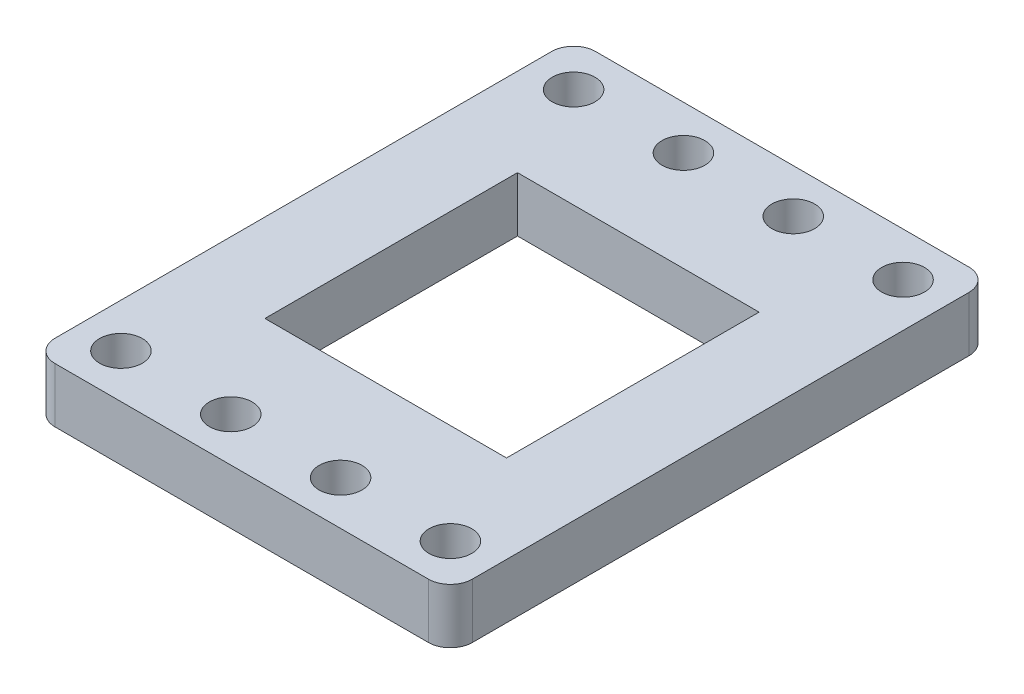
ISO-10303-21;
HEADER;
FILE_DESCRIPTION(('STEP AP214'),'2;1');
FILE_NAME('part.step','',(''),(''),'','','');
FILE_SCHEMA(('AUTOMOTIVE_DESIGN { 1 0 10303 214 1 1 1 1 }'));
ENDSEC;
DATA;
#1=APPLICATION_CONTEXT('core data for automotive mechanical design processes');
#2=APPLICATION_PROTOCOL_DEFINITION('international standard','automotive_design',2000,#1);
#3=PRODUCT_CONTEXT('',#1,'mechanical');
#4=PRODUCT('Part','Part','',(#3));
#5=PRODUCT_RELATED_PRODUCT_CATEGORY('part','',(#4));
#6=PRODUCT_DEFINITION_FORMATION('','',#4);
#7=PRODUCT_DEFINITION_CONTEXT('part definition',#1,'design');
#8=PRODUCT_DEFINITION('design','',#6,#7);
#9=PRODUCT_DEFINITION_SHAPE('','',#8);
#10=(LENGTH_UNIT() NAMED_UNIT(*) SI_UNIT(.MILLI.,.METRE.));
#11=(NAMED_UNIT(*) PLANE_ANGLE_UNIT() SI_UNIT($,.RADIAN.));
#12=(NAMED_UNIT(*) SI_UNIT($,.STERADIAN.) SOLID_ANGLE_UNIT());
#13=UNCERTAINTY_MEASURE_WITH_UNIT(LENGTH_MEASURE(1.E-05),#10,'distance_accuracy_value','');
#14=(GEOMETRIC_REPRESENTATION_CONTEXT(3) GLOBAL_UNCERTAINTY_ASSIGNED_CONTEXT((#13)) GLOBAL_UNIT_ASSIGNED_CONTEXT((#10,
#11,#12)) REPRESENTATION_CONTEXT('',''));
#15=CARTESIAN_POINT('',(0.,0.,0.));
#16=DIRECTION('',(0.,0.,1.));
#17=DIRECTION('',(1.,0.,0.));
#18=AXIS2_PLACEMENT_3D('',#15,#16,#17);
#19=CARTESIAN_POINT('',(-1.99999999999999,5.,47.22));
#20=DIRECTION('',(0.,-1.,0.));
#21=DIRECTION('',(0.,0.,-1.));
#22=AXIS2_PLACEMENT_3D('',#19,#20,#21);
#23=CYLINDRICAL_SURFACE('',#22,2.);
#24=CARTESIAN_POINT('',(-1.99999999999999,0.,47.22));
#25=DIRECTION('',(0.,1.,0.));
#26=DIRECTION('',(0.,0.,1.));
#27=AXIS2_PLACEMENT_3D('',#24,#25,#26);
#28=CIRCLE('',#27,2.);
#29=CARTESIAN_POINT('',(-1.99999999999999,0.,49.22));
#30=VERTEX_POINT('',#29);
#31=CARTESIAN_POINT('',(0.,0.,47.22));
#32=VERTEX_POINT('',#31);
#33=EDGE_CURVE('E201',#30,#32,#28,.T.);
#34=ORIENTED_EDGE('',*,*,#33,.T.);
#35=DIRECTION('',(0.,-1.,0.));
#36=VECTOR('',#35,1.);
#37=CARTESIAN_POINT('',(0.,5.,47.22));
#38=LINE('',#37,#36);
#39=CARTESIAN_POINT('',(0.,5.,47.22));
#40=VERTEX_POINT('',#39);
#41=EDGE_CURVE('E11',#40,#32,#38,.T.);
#42=ORIENTED_EDGE('',*,*,#41,.F.);
#43=CARTESIAN_POINT('',(-1.99999999999999,5.,47.22));
#44=DIRECTION('',(0.,1.,0.));
#45=DIRECTION('',(0.,0.,1.));
#46=AXIS2_PLACEMENT_3D('',#43,#44,#45);
#47=CIRCLE('',#46,2.);
#48=CARTESIAN_POINT('',(-1.99999999999999,5.,49.22));
#49=VERTEX_POINT('',#48);
#50=EDGE_CURVE('E204',#49,#40,#47,.T.);
#51=ORIENTED_EDGE('',*,*,#50,.F.);
#52=DIRECTION('',(0.,-1.,0.));
#53=VECTOR('',#52,1.);
#54=CARTESIAN_POINT('',(-1.99999999999999,5.,49.22));
#55=LINE('',#54,#53);
#56=EDGE_CURVE('E222',#49,#30,#55,.T.);
#57=ORIENTED_EDGE('',*,*,#56,.T.);
#58=EDGE_LOOP('',(#34,#42,#51,#57));
#59=FACE_BOUND('',#58,.T.);
#60=ADVANCED_FACE('F33',(#59),#23,.T.);
#61=CARTESIAN_POINT('',(0.,5.,2.));
#62=DIRECTION('',(-1.,0.,0.));
#63=DIRECTION('',(0.,0.,1.));
#64=AXIS2_PLACEMENT_3D('',#61,#62,#63);
#65=PLANE('',#64);
#66=DIRECTION('',(0.,0.,-1.));
#67=VECTOR('',#66,1.);
#68=CARTESIAN_POINT('',(0.,0.,2.));
#69=LINE('',#68,#67);
#70=CARTESIAN_POINT('',(0.,0.,2.));
#71=VERTEX_POINT('',#70);
#72=EDGE_CURVE('E225',#32,#71,#69,.T.);
#73=ORIENTED_EDGE('',*,*,#72,.T.);
#74=DIRECTION('',(0.,-1.,0.));
#75=VECTOR('',#74,1.);
#76=CARTESIAN_POINT('',(0.,5.,2.));
#77=LINE('',#76,#75);
#78=CARTESIAN_POINT('',(0.,5.,2.));
#79=VERTEX_POINT('',#78);
#80=EDGE_CURVE('E40',#79,#71,#77,.T.);
#81=ORIENTED_EDGE('',*,*,#80,.F.);
#82=DIRECTION('',(0.,0.,-1.));
#83=VECTOR('',#82,1.);
#84=CARTESIAN_POINT('',(0.,5.,2.));
#85=LINE('',#84,#83);
#86=EDGE_CURVE('E207',#40,#79,#85,.T.);
#87=ORIENTED_EDGE('',*,*,#86,.F.);
#88=ORIENTED_EDGE('',*,*,#41,.T.);
#89=EDGE_LOOP('',(#73,#81,#87,#88));
#90=FACE_BOUND('',#89,.T.);
#91=ADVANCED_FACE('F281',(#90),#65,.F.);
#92=CARTESIAN_POINT('',(-2.,5.,2.));
#93=DIRECTION('',(0.,-1.,0.));
#94=DIRECTION('',(0.,0.,-1.));
#95=AXIS2_PLACEMENT_3D('',#92,#93,#94);
#96=CYLINDRICAL_SURFACE('',#95,2.);
#97=CARTESIAN_POINT('',(-2.,0.,2.));
#98=DIRECTION('',(0.,1.,0.));
#99=DIRECTION('',(0.,0.,-1.));
#100=AXIS2_PLACEMENT_3D('',#97,#98,#99);
#101=CIRCLE('',#100,2.);
#102=CARTESIAN_POINT('',(-2.,0.,0.));
#103=VERTEX_POINT('',#102);
#104=EDGE_CURVE('E227',#71,#103,#101,.T.);
#105=ORIENTED_EDGE('',*,*,#104,.T.);
#106=DIRECTION('',(0.,-1.,0.));
#107=VECTOR('',#106,1.);
#108=CARTESIAN_POINT('',(-2.,5.,0.));
#109=LINE('',#108,#107);
#110=CARTESIAN_POINT('',(-2.,5.,0.));
#111=VERTEX_POINT('',#110);
#112=EDGE_CURVE('E252',#111,#103,#109,.T.);
#113=ORIENTED_EDGE('',*,*,#112,.F.);
#114=CARTESIAN_POINT('',(-2.,5.,2.));
#115=DIRECTION('',(0.,1.,0.));
#116=DIRECTION('',(0.,0.,-1.));
#117=AXIS2_PLACEMENT_3D('',#114,#115,#116);
#118=CIRCLE('',#117,2.);
#119=EDGE_CURVE('E210',#79,#111,#118,.T.);
#120=ORIENTED_EDGE('',*,*,#119,.F.);
#121=ORIENTED_EDGE('',*,*,#80,.T.);
#122=EDGE_LOOP('',(#105,#113,#120,#121));
#123=FACE_BOUND('',#122,.T.);
#124=ADVANCED_FACE('F259',(#123),#96,.T.);
#125=CARTESIAN_POINT('',(-36.,5.,0.));
#126=DIRECTION('',(0.,0.,1.));
#127=DIRECTION('',(1.,0.,0.));
#128=AXIS2_PLACEMENT_3D('',#125,#126,#127);
#129=PLANE('',#128);
#130=DIRECTION('',(-1.,0.,0.));
#131=VECTOR('',#130,1.);
#132=CARTESIAN_POINT('',(-36.,0.,0.));
#133=LINE('',#132,#131);
#134=CARTESIAN_POINT('',(-36.,0.,0.));
#135=VERTEX_POINT('',#134);
#136=EDGE_CURVE('E229',#103,#135,#133,.T.);
#137=ORIENTED_EDGE('',*,*,#136,.T.);
#138=DIRECTION('',(0.,-1.,0.));
#139=VECTOR('',#138,1.);
#140=CARTESIAN_POINT('',(-36.,5.,0.));
#141=LINE('',#140,#139);
#142=CARTESIAN_POINT('',(-36.,5.,0.));
#143=VERTEX_POINT('',#142);
#144=EDGE_CURVE('E249',#143,#135,#141,.T.);
#145=ORIENTED_EDGE('',*,*,#144,.F.);
#146=DIRECTION('',(-1.,0.,0.));
#147=VECTOR('',#146,1.);
#148=CARTESIAN_POINT('',(-36.,5.,0.));
#149=LINE('',#148,#147);
#150=EDGE_CURVE('E212',#111,#143,#149,.T.);
#151=ORIENTED_EDGE('',*,*,#150,.F.);
#152=ORIENTED_EDGE('',*,*,#112,.T.);
#153=EDGE_LOOP('',(#137,#145,#151,#152));
#154=FACE_BOUND('',#153,.T.);
#155=ADVANCED_FACE('F269',(#154),#129,.F.);
#156=CARTESIAN_POINT('',(-36.,5.,2.));
#157=DIRECTION('',(0.,-1.,0.));
#158=DIRECTION('',(0.,0.,-1.));
#159=AXIS2_PLACEMENT_3D('',#156,#157,#158);
#160=CYLINDRICAL_SURFACE('',#159,2.);
#161=CARTESIAN_POINT('',(-36.,0.,2.));
#162=DIRECTION('',(0.,1.,0.));
#163=DIRECTION('',(0.,0.,1.));
#164=AXIS2_PLACEMENT_3D('',#161,#162,#163);
#165=CIRCLE('',#164,2.);
#166=CARTESIAN_POINT('',(-38.,0.,2.));
#167=VERTEX_POINT('',#166);
#168=EDGE_CURVE('E231',#135,#167,#165,.T.);
#169=ORIENTED_EDGE('',*,*,#168,.T.);
#170=DIRECTION('',(0.,-1.,0.));
#171=VECTOR('',#170,1.);
#172=CARTESIAN_POINT('',(-38.,5.,2.));
#173=LINE('',#172,#171);
#174=CARTESIAN_POINT('',(-38.,5.,2.));
#175=VERTEX_POINT('',#174);
#176=EDGE_CURVE('E246',#175,#167,#173,.T.);
#177=ORIENTED_EDGE('',*,*,#176,.F.);
#178=CARTESIAN_POINT('',(-36.,5.,2.));
#179=DIRECTION('',(0.,1.,0.));
#180=DIRECTION('',(0.,0.,1.));
#181=AXIS2_PLACEMENT_3D('',#178,#179,#180);
#182=CIRCLE('',#181,2.);
#183=EDGE_CURVE('E214',#143,#175,#182,.T.);
#184=ORIENTED_EDGE('',*,*,#183,.F.);
#185=ORIENTED_EDGE('',*,*,#144,.T.);
#186=EDGE_LOOP('',(#169,#177,#184,#185));
#187=FACE_BOUND('',#186,.T.);
#188=ADVANCED_FACE('F273',(#187),#160,.T.);
#189=CARTESIAN_POINT('',(-38.,5.,2.));
#190=DIRECTION('',(1.,0.,0.));
#191=DIRECTION('',(0.,0.,-1.));
#192=AXIS2_PLACEMENT_3D('',#189,#190,#191);
#193=PLANE('',#192);
#194=DIRECTION('',(0.,0.,1.));
#195=VECTOR('',#194,1.);
#196=CARTESIAN_POINT('',(-38.,0.,2.));
#197=LINE('',#196,#195);
#198=CARTESIAN_POINT('',(-38.,0.,47.22));
#199=VERTEX_POINT('',#198);
#200=EDGE_CURVE('E233',#167,#199,#197,.T.);
#201=ORIENTED_EDGE('',*,*,#200,.T.);
#202=DIRECTION('',(0.,-1.,0.));
#203=VECTOR('',#202,1.);
#204=CARTESIAN_POINT('',(-38.,5.,47.22));
#205=LINE('',#204,#203);
#206=CARTESIAN_POINT('',(-38.,5.,47.22));
#207=VERTEX_POINT('',#206);
#208=EDGE_CURVE('E243',#207,#199,#205,.T.);
#209=ORIENTED_EDGE('',*,*,#208,.F.);
#210=DIRECTION('',(0.,0.,1.));
#211=VECTOR('',#210,1.);
#212=CARTESIAN_POINT('',(-38.,5.,2.));
#213=LINE('',#212,#211);
#214=EDGE_CURVE('E216',#175,#207,#213,.T.);
#215=ORIENTED_EDGE('',*,*,#214,.F.);
#216=ORIENTED_EDGE('',*,*,#176,.T.);
#217=EDGE_LOOP('',(#201,#209,#215,#216));
#218=FACE_BOUND('',#217,.T.);
#219=ADVANCED_FACE('F294',(#218),#193,.F.);
#220=CARTESIAN_POINT('',(-36.,5.,47.22));
#221=DIRECTION('',(0.,-1.,0.));
#222=DIRECTION('',(0.,0.,-1.));
#223=AXIS2_PLACEMENT_3D('',#220,#221,#222);
#224=CYLINDRICAL_SURFACE('',#223,2.);
#225=CARTESIAN_POINT('',(-36.,0.,47.22));
#226=DIRECTION('',(0.,1.,0.));
#227=DIRECTION('',(0.,0.,1.));
#228=AXIS2_PLACEMENT_3D('',#225,#226,#227);
#229=CIRCLE('',#228,2.);
#230=CARTESIAN_POINT('',(-36.,0.,49.22));
#231=VERTEX_POINT('',#230);
#232=EDGE_CURVE('E235',#199,#231,#229,.T.);
#233=ORIENTED_EDGE('',*,*,#232,.T.);
#234=DIRECTION('',(0.,-1.,0.));
#235=VECTOR('',#234,1.);
#236=CARTESIAN_POINT('',(-36.,5.,49.22));
#237=LINE('',#236,#235);
#238=CARTESIAN_POINT('',(-36.,5.,49.22));
#239=VERTEX_POINT('',#238);
#240=EDGE_CURVE('E240',#239,#231,#237,.T.);
#241=ORIENTED_EDGE('',*,*,#240,.F.);
#242=CARTESIAN_POINT('',(-36.,5.,47.22));
#243=DIRECTION('',(0.,1.,0.));
#244=DIRECTION('',(0.,0.,1.));
#245=AXIS2_PLACEMENT_3D('',#242,#243,#244);
#246=CIRCLE('',#245,2.);
#247=EDGE_CURVE('E218',#207,#239,#246,.T.);
#248=ORIENTED_EDGE('',*,*,#247,.F.);
#249=ORIENTED_EDGE('',*,*,#208,.T.);
#250=EDGE_LOOP('',(#233,#241,#248,#249));
#251=FACE_BOUND('',#250,.T.);
#252=ADVANCED_FACE('F292',(#251),#224,.T.);
#253=CARTESIAN_POINT('',(-36.,5.,49.22));
#254=DIRECTION('',(0.,0.,-1.));
#255=DIRECTION('',(-1.,0.,0.));
#256=AXIS2_PLACEMENT_3D('',#253,#254,#255);
#257=PLANE('',#256);
#258=DIRECTION('',(1.,0.,0.));
#259=VECTOR('',#258,1.);
#260=CARTESIAN_POINT('',(-36.,0.,49.22));
#261=LINE('',#260,#259);
#262=EDGE_CURVE('E208',#231,#30,#261,.T.);
#263=ORIENTED_EDGE('',*,*,#262,.T.);
#264=ORIENTED_EDGE('',*,*,#56,.F.);
#265=DIRECTION('',(1.,0.,0.));
#266=VECTOR('',#265,1.);
#267=CARTESIAN_POINT('',(-36.,5.,49.22));
#268=LINE('',#267,#266);
#269=EDGE_CURVE('E220',#239,#49,#268,.T.);
#270=ORIENTED_EDGE('',*,*,#269,.F.);
#271=ORIENTED_EDGE('',*,*,#240,.T.);
#272=EDGE_LOOP('',(#263,#264,#270,#271));
#273=FACE_BOUND('',#272,.T.);
#274=ADVANCED_FACE('F287',(#273),#257,.F.);
#275=CARTESIAN_POINT('',(-1.99999999999999,5.,47.22));
#276=DIRECTION('',(0.,1.,0.));
#277=DIRECTION('',(0.,0.,1.));
#278=AXIS2_PLACEMENT_3D('',#275,#276,#277);
#279=PLANE('',#278);
#280=CARTESIAN_POINT('',(-34.,5.,4.));
#281=DIRECTION('',(0.,1.,0.));
#282=DIRECTION('',(0.,0.,1.));
#283=AXIS2_PLACEMENT_3D('',#280,#281,#282);
#284=CIRCLE('',#283,1.95);
#285=CARTESIAN_POINT('',(-34.,5.,5.95));
#286=VERTEX_POINT('',#285);
#287=EDGE_CURVE('E177',#286,#286,#284,.T.);
#288=ORIENTED_EDGE('',*,*,#287,.F.);
#289=EDGE_LOOP('',(#288));
#290=FACE_BOUND('',#289,.T.);
#291=CARTESIAN_POINT('',(-34.,5.,45.22));
#292=DIRECTION('',(0.,1.,0.));
#293=DIRECTION('',(0.,0.,-1.));
#294=AXIS2_PLACEMENT_3D('',#291,#292,#293);
#295=CIRCLE('',#294,1.95);
#296=CARTESIAN_POINT('',(-34.,5.,43.27));
#297=VERTEX_POINT('',#296);
#298=EDGE_CURVE('E163',#297,#297,#295,.T.);
#299=ORIENTED_EDGE('',*,*,#298,.F.);
#300=EDGE_LOOP('',(#299));
#301=FACE_BOUND('',#300,.T.);
#302=CARTESIAN_POINT('',(-24.,5.,4.));
#303=DIRECTION('',(0.,1.,0.));
#304=DIRECTION('',(0.,0.,1.));
#305=AXIS2_PLACEMENT_3D('',#302,#303,#304);
#306=CIRCLE('',#305,1.95);
#307=CARTESIAN_POINT('',(-24.,5.,5.95));
#308=VERTEX_POINT('',#307);
#309=EDGE_CURVE('E183',#308,#308,#306,.T.);
#310=ORIENTED_EDGE('',*,*,#309,.F.);
#311=EDGE_LOOP('',(#310));
#312=FACE_BOUND('',#311,.T.);
#313=CARTESIAN_POINT('',(-14.,5.,4.));
#314=DIRECTION('',(0.,1.,0.));
#315=DIRECTION('',(0.,0.,1.));
#316=AXIS2_PLACEMENT_3D('',#313,#314,#315);
#317=CIRCLE('',#316,1.95);
#318=CARTESIAN_POINT('',(-14.,5.,5.94999999999999));
#319=VERTEX_POINT('',#318);
#320=EDGE_CURVE('E190',#319,#319,#317,.T.);
#321=ORIENTED_EDGE('',*,*,#320,.F.);
#322=EDGE_LOOP('',(#321));
#323=FACE_BOUND('',#322,.T.);
#324=DIRECTION('',(0.,0.,1.));
#325=VECTOR('',#324,1.);
#326=CARTESIAN_POINT('',(-30.,5.,13.11));
#327=LINE('',#326,#325);
#328=CARTESIAN_POINT('',(-30.,5.,13.11));
#329=VERTEX_POINT('',#328);
#330=CARTESIAN_POINT('',(-30.,5.,36.11));
#331=VERTEX_POINT('',#330);
#332=EDGE_CURVE('E47',#329,#331,#327,.T.);
#333=ORIENTED_EDGE('',*,*,#332,.F.);
#334=DIRECTION('',(-1.,0.,0.));
#335=VECTOR('',#334,1.);
#336=CARTESIAN_POINT('',(-30.,5.,13.11));
#337=LINE('',#336,#335);
#338=CARTESIAN_POINT('',(-7.99999999999999,5.,13.11));
#339=VERTEX_POINT('',#338);
#340=EDGE_CURVE('E139',#339,#329,#337,.T.);
#341=ORIENTED_EDGE('',*,*,#340,.F.);
#342=DIRECTION('',(0.,0.,-1.));
#343=VECTOR('',#342,1.);
#344=CARTESIAN_POINT('',(-7.99999999999999,5.,13.11));
#345=LINE('',#344,#343);
#346=CARTESIAN_POINT('',(-7.99999999999999,5.,36.11));
#347=VERTEX_POINT('',#346);
#348=EDGE_CURVE('E142',#347,#339,#345,.T.);
#349=ORIENTED_EDGE('',*,*,#348,.F.);
#350=DIRECTION('',(1.,0.,0.));
#351=VECTOR('',#350,1.);
#352=CARTESIAN_POINT('',(-30.,5.,36.11));
#353=LINE('',#352,#351);
#354=EDGE_CURVE('E151',#331,#347,#353,.T.);
#355=ORIENTED_EDGE('',*,*,#354,.F.);
#356=EDGE_LOOP('',(#333,#341,#349,#355));
#357=FACE_BOUND('',#356,.T.);
#358=CARTESIAN_POINT('',(-4.,5.,45.22));
#359=DIRECTION('',(0.,1.,0.));
#360=DIRECTION('',(0.,0.,-1.));
#361=AXIS2_PLACEMENT_3D('',#358,#359,#360);
#362=CIRCLE('',#361,1.95);
#363=CARTESIAN_POINT('',(-4.,5.,43.27));
#364=VERTEX_POINT('',#363);
#365=EDGE_CURVE('E145',#364,#364,#362,.T.);
#366=ORIENTED_EDGE('',*,*,#365,.F.);
#367=EDGE_LOOP('',(#366));
#368=FACE_BOUND('',#367,.T.);
#369=CARTESIAN_POINT('',(-14.,5.,45.22));
#370=DIRECTION('',(0.,1.,0.));
#371=DIRECTION('',(0.,0.,-1.));
#372=AXIS2_PLACEMENT_3D('',#369,#370,#371);
#373=CIRCLE('',#372,1.95);
#374=CARTESIAN_POINT('',(-14.,5.,43.27));
#375=VERTEX_POINT('',#374);
#376=EDGE_CURVE('E170',#375,#375,#373,.T.);
#377=ORIENTED_EDGE('',*,*,#376,.F.);
#378=EDGE_LOOP('',(#377));
#379=FACE_BOUND('',#378,.T.);
#380=CARTESIAN_POINT('',(-24.,5.,45.22));
#381=DIRECTION('',(0.,1.,0.));
#382=DIRECTION('',(0.,0.,-1.));
#383=AXIS2_PLACEMENT_3D('',#380,#381,#382);
#384=CIRCLE('',#383,1.95);
#385=CARTESIAN_POINT('',(-24.,5.,43.27));
#386=VERTEX_POINT('',#385);
#387=EDGE_CURVE('E164',#386,#386,#384,.T.);
#388=ORIENTED_EDGE('',*,*,#387,.F.);
#389=EDGE_LOOP('',(#388));
#390=FACE_BOUND('',#389,.T.);
#391=CARTESIAN_POINT('',(-4.,5.,4.));
#392=DIRECTION('',(0.,1.,0.));
#393=DIRECTION('',(0.,0.,1.));
#394=AXIS2_PLACEMENT_3D('',#391,#392,#393);
#395=CIRCLE('',#394,1.95);
#396=CARTESIAN_POINT('',(-4.,5.,5.94999999999999));
#397=VERTEX_POINT('',#396);
#398=EDGE_CURVE('E189',#397,#397,#395,.T.);
#399=ORIENTED_EDGE('',*,*,#398,.F.);
#400=EDGE_LOOP('',(#399));
#401=FACE_BOUND('',#400,.T.);
#402=ORIENTED_EDGE('',*,*,#50,.T.);
#403=ORIENTED_EDGE('',*,*,#86,.T.);
#404=ORIENTED_EDGE('',*,*,#119,.T.);
#405=ORIENTED_EDGE('',*,*,#150,.T.);
#406=ORIENTED_EDGE('',*,*,#183,.T.);
#407=ORIENTED_EDGE('',*,*,#214,.T.);
#408=ORIENTED_EDGE('',*,*,#247,.T.);
#409=ORIENTED_EDGE('',*,*,#269,.T.);
#410=EDGE_LOOP('',(#402,#403,#404,#405,#406,#407,#408,#409));
#411=FACE_BOUND('',#410,.T.);
#412=ADVANCED_FACE('F277',(#290,#301,#312,#323,#357,#368,#379,#390,#401,#411),#279,.T.);
#413=CARTESIAN_POINT('',(-1.99999999999999,0.,47.22));
#414=DIRECTION('',(0.,1.,0.));
#415=DIRECTION('',(0.,0.,1.));
#416=AXIS2_PLACEMENT_3D('',#413,#414,#415);
#417=PLANE('',#416);
#418=CARTESIAN_POINT('',(-34.,0.,4.));
#419=DIRECTION('',(0.,1.,0.));
#420=DIRECTION('',(0.,0.,1.));
#421=AXIS2_PLACEMENT_3D('',#418,#419,#420);
#422=CIRCLE('',#421,1.95);
#423=CARTESIAN_POINT('',(-34.,0.,5.95));
#424=VERTEX_POINT('',#423);
#425=EDGE_CURVE('E180',#424,#424,#422,.T.);
#426=ORIENTED_EDGE('',*,*,#425,.T.);
#427=EDGE_LOOP('',(#426));
#428=FACE_BOUND('',#427,.T.);
#429=CARTESIAN_POINT('',(-34.,0.,45.22));
#430=DIRECTION('',(0.,1.,0.));
#431=DIRECTION('',(0.,0.,-1.));
#432=AXIS2_PLACEMENT_3D('',#429,#430,#431);
#433=CIRCLE('',#432,1.95);
#434=CARTESIAN_POINT('',(-34.,0.,43.27));
#435=VERTEX_POINT('',#434);
#436=EDGE_CURVE('E174',#435,#435,#433,.T.);
#437=ORIENTED_EDGE('',*,*,#436,.T.);
#438=EDGE_LOOP('',(#437));
#439=FACE_BOUND('',#438,.T.);
#440=CARTESIAN_POINT('',(-24.,0.,4.));
#441=DIRECTION('',(0.,1.,0.));
#442=DIRECTION('',(0.,0.,1.));
#443=AXIS2_PLACEMENT_3D('',#440,#441,#442);
#444=CIRCLE('',#443,1.95);
#445=CARTESIAN_POINT('',(-24.,0.,5.95));
#446=VERTEX_POINT('',#445);
#447=EDGE_CURVE('E193',#446,#446,#444,.T.);
#448=ORIENTED_EDGE('',*,*,#447,.T.);
#449=EDGE_LOOP('',(#448));
#450=FACE_BOUND('',#449,.T.);
#451=CARTESIAN_POINT('',(-14.,0.,4.));
#452=DIRECTION('',(0.,1.,0.));
#453=DIRECTION('',(0.,0.,1.));
#454=AXIS2_PLACEMENT_3D('',#451,#452,#453);
#455=CIRCLE('',#454,1.95);
#456=CARTESIAN_POINT('',(-14.,0.,5.94999999999999));
#457=VERTEX_POINT('',#456);
#458=EDGE_CURVE('E186',#457,#457,#455,.T.);
#459=ORIENTED_EDGE('',*,*,#458,.T.);
#460=EDGE_LOOP('',(#459));
#461=FACE_BOUND('',#460,.T.);
#462=DIRECTION('',(-1.,0.,0.));
#463=VECTOR('',#462,1.);
#464=CARTESIAN_POINT('',(-30.,0.,13.11));
#465=LINE('',#464,#463);
#466=CARTESIAN_POINT('',(-7.99999999999999,0.,13.11));
#467=VERTEX_POINT('',#466);
#468=CARTESIAN_POINT('',(-30.,0.,13.11));
#469=VERTEX_POINT('',#468);
#470=EDGE_CURVE('E129',#467,#469,#465,.T.);
#471=ORIENTED_EDGE('',*,*,#470,.T.);
#472=DIRECTION('',(0.,0.,1.));
#473=VECTOR('',#472,1.);
#474=CARTESIAN_POINT('',(-30.,0.,13.11));
#475=LINE('',#474,#473);
#476=CARTESIAN_POINT('',(-30.,0.,36.11));
#477=VERTEX_POINT('',#476);
#478=EDGE_CURVE('E123',#469,#477,#475,.T.);
#479=ORIENTED_EDGE('',*,*,#478,.T.);
#480=DIRECTION('',(1.,0.,0.));
#481=VECTOR('',#480,1.);
#482=CARTESIAN_POINT('',(-30.,0.,36.11));
#483=LINE('',#482,#481);
#484=CARTESIAN_POINT('',(-7.99999999999999,0.,36.11));
#485=VERTEX_POINT('',#484);
#486=EDGE_CURVE('E132',#477,#485,#483,.T.);
#487=ORIENTED_EDGE('',*,*,#486,.T.);
#488=DIRECTION('',(0.,0.,-1.));
#489=VECTOR('',#488,1.);
#490=CARTESIAN_POINT('',(-7.99999999999999,0.,13.11));
#491=LINE('',#490,#489);
#492=EDGE_CURVE('E55',#485,#467,#491,.T.);
#493=ORIENTED_EDGE('',*,*,#492,.T.);
#494=EDGE_LOOP('',(#471,#479,#487,#493));
#495=FACE_BOUND('',#494,.T.);
#496=CARTESIAN_POINT('',(-4.,0.,45.22));
#497=DIRECTION('',(0.,1.,0.));
#498=DIRECTION('',(0.,0.,-1.));
#499=AXIS2_PLACEMENT_3D('',#496,#497,#498);
#500=CIRCLE('',#499,1.95);
#501=CARTESIAN_POINT('',(-4.,0.,43.27));
#502=VERTEX_POINT('',#501);
#503=EDGE_CURVE('E173',#502,#502,#500,.T.);
#504=ORIENTED_EDGE('',*,*,#503,.T.);
#505=EDGE_LOOP('',(#504));
#506=FACE_BOUND('',#505,.T.);
#507=CARTESIAN_POINT('',(-14.,0.,45.22));
#508=DIRECTION('',(0.,1.,0.));
#509=DIRECTION('',(0.,0.,-1.));
#510=AXIS2_PLACEMENT_3D('',#507,#508,#509);
#511=CIRCLE('',#510,1.95);
#512=CARTESIAN_POINT('',(-14.,0.,43.27));
#513=VERTEX_POINT('',#512);
#514=EDGE_CURVE('E167',#513,#513,#511,.T.);
#515=ORIENTED_EDGE('',*,*,#514,.T.);
#516=EDGE_LOOP('',(#515));
#517=FACE_BOUND('',#516,.T.);
#518=CARTESIAN_POINT('',(-24.,0.,45.22));
#519=DIRECTION('',(0.,1.,0.));
#520=DIRECTION('',(0.,0.,-1.));
#521=AXIS2_PLACEMENT_3D('',#518,#519,#520);
#522=CIRCLE('',#521,1.95);
#523=CARTESIAN_POINT('',(-24.,0.,43.27));
#524=VERTEX_POINT('',#523);
#525=EDGE_CURVE('E160',#524,#524,#522,.T.);
#526=ORIENTED_EDGE('',*,*,#525,.T.);
#527=EDGE_LOOP('',(#526));
#528=FACE_BOUND('',#527,.T.);
#529=CARTESIAN_POINT('',(-4.,0.,4.));
#530=DIRECTION('',(0.,1.,0.));
#531=DIRECTION('',(0.,0.,1.));
#532=AXIS2_PLACEMENT_3D('',#529,#530,#531);
#533=CIRCLE('',#532,1.95);
#534=CARTESIAN_POINT('',(-4.,0.,5.94999999999999));
#535=VERTEX_POINT('',#534);
#536=EDGE_CURVE('E198',#535,#535,#533,.T.);
#537=ORIENTED_EDGE('',*,*,#536,.T.);
#538=EDGE_LOOP('',(#537));
#539=FACE_BOUND('',#538,.T.);
#540=ORIENTED_EDGE('',*,*,#33,.F.);
#541=ORIENTED_EDGE('',*,*,#262,.F.);
#542=ORIENTED_EDGE('',*,*,#232,.F.);
#543=ORIENTED_EDGE('',*,*,#200,.F.);
#544=ORIENTED_EDGE('',*,*,#168,.F.);
#545=ORIENTED_EDGE('',*,*,#136,.F.);
#546=ORIENTED_EDGE('',*,*,#104,.F.);
#547=ORIENTED_EDGE('',*,*,#72,.F.);
#548=EDGE_LOOP('',(#540,#541,#542,#543,#544,#545,#546,#547));
#549=FACE_BOUND('',#548,.T.);
#550=ADVANCED_FACE('F136',(#428,#439,#450,#461,#495,#506,#517,#528,#539,#549),#417,.F.);
#551=CARTESIAN_POINT('',(-4.,0.,4.));
#552=DIRECTION('',(0.,1.,0.));
#553=DIRECTION('',(0.,0.,1.));
#554=AXIS2_PLACEMENT_3D('',#551,#552,#553);
#555=CYLINDRICAL_SURFACE('',#554,1.95);
#556=ORIENTED_EDGE('',*,*,#536,.F.);
#557=EDGE_LOOP('',(#556));
#558=FACE_BOUND('',#557,.T.);
#559=ORIENTED_EDGE('',*,*,#398,.T.);
#560=EDGE_LOOP('',(#559));
#561=FACE_BOUND('',#560,.T.);
#562=ADVANCED_FACE('F357',(#558,#561),#555,.F.);
#563=CARTESIAN_POINT('',(-24.,0.,45.22));
#564=DIRECTION('',(0.,1.,0.));
#565=DIRECTION('',(0.,0.,1.));
#566=AXIS2_PLACEMENT_3D('',#563,#564,#565);
#567=CYLINDRICAL_SURFACE('',#566,1.95);
#568=ORIENTED_EDGE('',*,*,#525,.F.);
#569=EDGE_LOOP('',(#568));
#570=FACE_BOUND('',#569,.T.);
#571=ORIENTED_EDGE('',*,*,#387,.T.);
#572=EDGE_LOOP('',(#571));
#573=FACE_BOUND('',#572,.T.);
#574=ADVANCED_FACE('F367',(#570,#573),#567,.F.);
#575=CARTESIAN_POINT('',(-14.,0.,45.22));
#576=DIRECTION('',(0.,1.,0.));
#577=DIRECTION('',(0.,0.,1.));
#578=AXIS2_PLACEMENT_3D('',#575,#576,#577);
#579=CYLINDRICAL_SURFACE('',#578,1.95);
#580=ORIENTED_EDGE('',*,*,#514,.F.);
#581=EDGE_LOOP('',(#580));
#582=FACE_BOUND('',#581,.T.);
#583=ORIENTED_EDGE('',*,*,#376,.T.);
#584=EDGE_LOOP('',(#583));
#585=FACE_BOUND('',#584,.T.);
#586=ADVANCED_FACE('F377',(#582,#585),#579,.F.);
#587=CARTESIAN_POINT('',(-4.,0.,45.22));
#588=DIRECTION('',(0.,1.,0.));
#589=DIRECTION('',(0.,0.,1.));
#590=AXIS2_PLACEMENT_3D('',#587,#588,#589);
#591=CYLINDRICAL_SURFACE('',#590,1.95);
#592=ORIENTED_EDGE('',*,*,#503,.F.);
#593=EDGE_LOOP('',(#592));
#594=FACE_BOUND('',#593,.T.);
#595=ORIENTED_EDGE('',*,*,#365,.T.);
#596=EDGE_LOOP('',(#595));
#597=FACE_BOUND('',#596,.T.);
#598=ADVANCED_FACE('F387',(#594,#597),#591,.F.);
#599=CARTESIAN_POINT('',(-30.,0.,13.11));
#600=DIRECTION('',(-1.,0.,0.));
#601=DIRECTION('',(0.,0.,1.));
#602=AXIS2_PLACEMENT_3D('',#599,#600,#601);
#603=PLANE('',#602);
#604=ORIENTED_EDGE('',*,*,#332,.T.);
#605=DIRECTION('',(0.,1.,0.));
#606=VECTOR('',#605,1.);
#607=CARTESIAN_POINT('',(-30.,0.,36.11));
#608=LINE('',#607,#606);
#609=EDGE_CURVE('E119',#477,#331,#608,.T.);
#610=ORIENTED_EDGE('',*,*,#609,.F.);
#611=ORIENTED_EDGE('',*,*,#478,.F.);
#612=DIRECTION('',(0.,1.,0.));
#613=VECTOR('',#612,1.);
#614=CARTESIAN_POINT('',(-30.,0.,13.11));
#615=LINE('',#614,#613);
#616=EDGE_CURVE('E155',#469,#329,#615,.T.);
#617=ORIENTED_EDGE('',*,*,#616,.T.);
#618=EDGE_LOOP('',(#604,#610,#611,#617));
#619=FACE_BOUND('',#618,.T.);
#620=ADVANCED_FACE('F121',(#619),#603,.F.);
#621=CARTESIAN_POINT('',(-30.,0.,13.11));
#622=DIRECTION('',(0.,0.,-1.));
#623=DIRECTION('',(-1.,0.,0.));
#624=AXIS2_PLACEMENT_3D('',#621,#622,#623);
#625=PLANE('',#624);
#626=ORIENTED_EDGE('',*,*,#340,.T.);
#627=ORIENTED_EDGE('',*,*,#616,.F.);
#628=ORIENTED_EDGE('',*,*,#470,.F.);
#629=DIRECTION('',(0.,1.,0.));
#630=VECTOR('',#629,1.);
#631=CARTESIAN_POINT('',(-7.99999999999999,0.,13.11));
#632=LINE('',#631,#630);
#633=EDGE_CURVE('E157',#467,#339,#632,.T.);
#634=ORIENTED_EDGE('',*,*,#633,.T.);
#635=EDGE_LOOP('',(#626,#627,#628,#634));
#636=FACE_BOUND('',#635,.T.);
#637=ADVANCED_FACE('F406',(#636),#625,.F.);
#638=CARTESIAN_POINT('',(-7.99999999999999,0.,13.11));
#639=DIRECTION('',(1.,0.,0.));
#640=DIRECTION('',(0.,0.,-1.));
#641=AXIS2_PLACEMENT_3D('',#638,#639,#640);
#642=PLANE('',#641);
#643=ORIENTED_EDGE('',*,*,#348,.T.);
#644=ORIENTED_EDGE('',*,*,#633,.F.);
#645=ORIENTED_EDGE('',*,*,#492,.F.);
#646=DIRECTION('',(0.,1.,0.));
#647=VECTOR('',#646,1.);
#648=CARTESIAN_POINT('',(-7.99999999999999,0.,36.11));
#649=LINE('',#648,#647);
#650=EDGE_CURVE('E128',#485,#347,#649,.T.);
#651=ORIENTED_EDGE('',*,*,#650,.T.);
#652=EDGE_LOOP('',(#643,#644,#645,#651));
#653=FACE_BOUND('',#652,.T.);
#654=ADVANCED_FACE('F415',(#653),#642,.F.);
#655=CARTESIAN_POINT('',(-30.,0.,36.11));
#656=DIRECTION('',(0.,0.,1.));
#657=DIRECTION('',(1.,0.,0.));
#658=AXIS2_PLACEMENT_3D('',#655,#656,#657);
#659=PLANE('',#658);
#660=ORIENTED_EDGE('',*,*,#354,.T.);
#661=ORIENTED_EDGE('',*,*,#650,.F.);
#662=ORIENTED_EDGE('',*,*,#486,.F.);
#663=ORIENTED_EDGE('',*,*,#609,.T.);
#664=EDGE_LOOP('',(#660,#661,#662,#663));
#665=FACE_BOUND('',#664,.T.);
#666=ADVANCED_FACE('F133',(#665),#659,.F.);
#667=CARTESIAN_POINT('',(-14.,0.,4.));
#668=DIRECTION('',(0.,1.,0.));
#669=DIRECTION('',(0.,0.,1.));
#670=AXIS2_PLACEMENT_3D('',#667,#668,#669);
#671=CYLINDRICAL_SURFACE('',#670,1.95);
#672=ORIENTED_EDGE('',*,*,#458,.F.);
#673=EDGE_LOOP('',(#672));
#674=FACE_BOUND('',#673,.T.);
#675=ORIENTED_EDGE('',*,*,#320,.T.);
#676=EDGE_LOOP('',(#675));
#677=FACE_BOUND('',#676,.T.);
#678=ADVANCED_FACE('F433',(#674,#677),#671,.F.);
#679=CARTESIAN_POINT('',(-24.,0.,4.));
#680=DIRECTION('',(0.,1.,0.));
#681=DIRECTION('',(0.,0.,1.));
#682=AXIS2_PLACEMENT_3D('',#679,#680,#681);
#683=CYLINDRICAL_SURFACE('',#682,1.95);
#684=ORIENTED_EDGE('',*,*,#447,.F.);
#685=EDGE_LOOP('',(#684));
#686=FACE_BOUND('',#685,.T.);
#687=ORIENTED_EDGE('',*,*,#309,.T.);
#688=EDGE_LOOP('',(#687));
#689=FACE_BOUND('',#688,.T.);
#690=ADVANCED_FACE('F442',(#686,#689),#683,.F.);
#691=CARTESIAN_POINT('',(-34.,0.,45.22));
#692=DIRECTION('',(0.,1.,0.));
#693=DIRECTION('',(0.,0.,1.));
#694=AXIS2_PLACEMENT_3D('',#691,#692,#693);
#695=CYLINDRICAL_SURFACE('',#694,1.95);
#696=ORIENTED_EDGE('',*,*,#436,.F.);
#697=EDGE_LOOP('',(#696));
#698=FACE_BOUND('',#697,.T.);
#699=ORIENTED_EDGE('',*,*,#298,.T.);
#700=EDGE_LOOP('',(#699));
#701=FACE_BOUND('',#700,.T.);
#702=ADVANCED_FACE('F452',(#698,#701),#695,.F.);
#703=CARTESIAN_POINT('',(-34.,0.,4.));
#704=DIRECTION('',(0.,1.,0.));
#705=DIRECTION('',(0.,0.,1.));
#706=AXIS2_PLACEMENT_3D('',#703,#704,#705);
#707=CYLINDRICAL_SURFACE('',#706,1.95);
#708=ORIENTED_EDGE('',*,*,#425,.F.);
#709=EDGE_LOOP('',(#708));
#710=FACE_BOUND('',#709,.T.);
#711=ORIENTED_EDGE('',*,*,#287,.T.);
#712=EDGE_LOOP('',(#711));
#713=FACE_BOUND('',#712,.T.);
#714=ADVANCED_FACE('F462',(#710,#713),#707,.F.);
#715=CLOSED_SHELL('',(#60,#91,#124,#155,#188,#219,#252,#274,#412,#550,#562,#574,#586,#598,#620,
#637,#654,#666,#678,#690,#702,#714));
#716=MANIFOLD_SOLID_BREP('B2',#715);
#717=ADVANCED_BREP_SHAPE_REPRESENTATION('',(#18,#716),#14);
#718=SHAPE_DEFINITION_REPRESENTATION(#9,#717);
ENDSEC;
END-ISO-10303-21;
